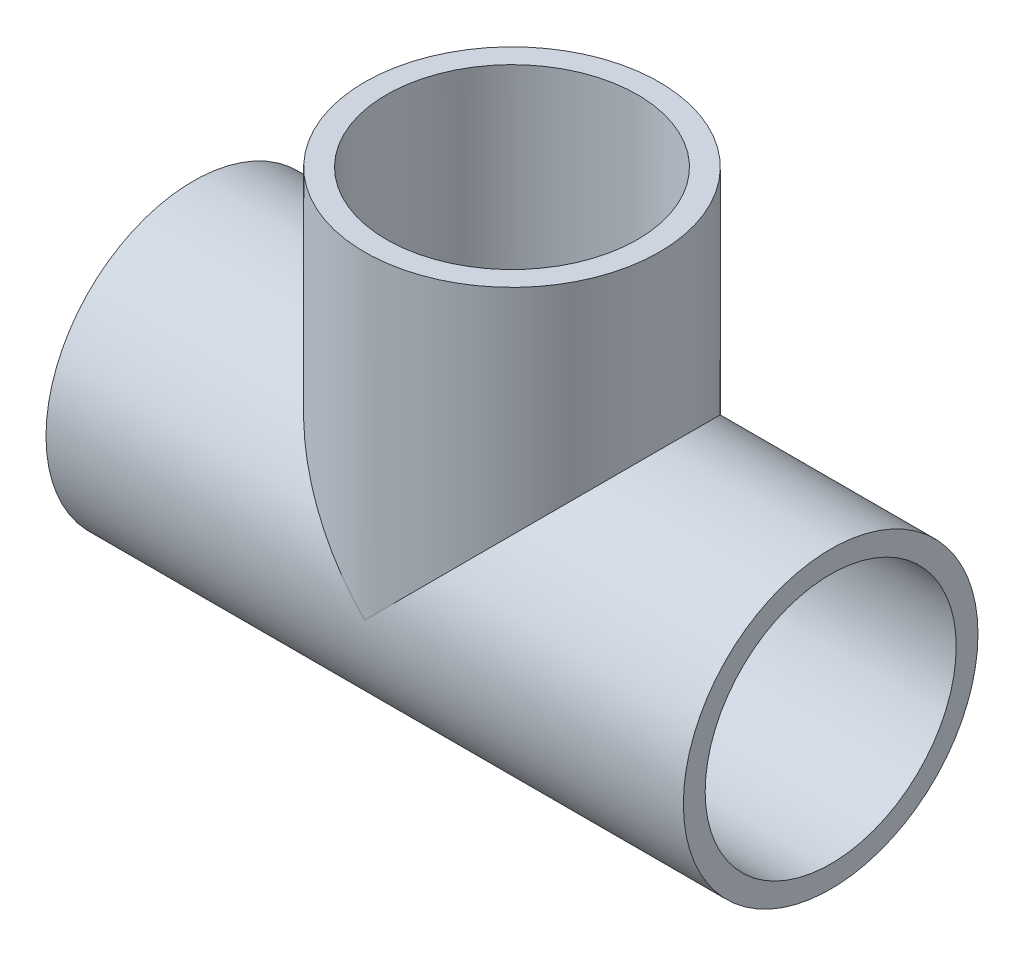
ISO-10303-21;
HEADER;
FILE_DESCRIPTION(('STEP AP214'),'2;1');
FILE_NAME('part.step','',(''),(''),'','','');
FILE_SCHEMA(('AUTOMOTIVE_DESIGN { 1 0 10303 214 1 1 1 1 }'));
ENDSEC;
DATA;
#1=APPLICATION_CONTEXT('core data for automotive mechanical design processes');
#2=APPLICATION_PROTOCOL_DEFINITION('international standard','automotive_design',2000,#1);
#3=PRODUCT_CONTEXT('',#1,'mechanical');
#4=PRODUCT('Part','Part','',(#3));
#5=PRODUCT_RELATED_PRODUCT_CATEGORY('part','',(#4));
#6=PRODUCT_DEFINITION_FORMATION('','',#4);
#7=PRODUCT_DEFINITION_CONTEXT('part definition',#1,'design');
#8=PRODUCT_DEFINITION('design','',#6,#7);
#9=PRODUCT_DEFINITION_SHAPE('','',#8);
#10=(LENGTH_UNIT() NAMED_UNIT(*) SI_UNIT(.MILLI.,.METRE.));
#11=(NAMED_UNIT(*) PLANE_ANGLE_UNIT() SI_UNIT($,.RADIAN.));
#12=(NAMED_UNIT(*) SI_UNIT($,.STERADIAN.) SOLID_ANGLE_UNIT());
#13=UNCERTAINTY_MEASURE_WITH_UNIT(LENGTH_MEASURE(1.E-05),#10,'distance_accuracy_value','');
#14=(GEOMETRIC_REPRESENTATION_CONTEXT(3) GLOBAL_UNCERTAINTY_ASSIGNED_CONTEXT((#13)) GLOBAL_UNIT_ASSIGNED_CONTEXT((#10,
#11,#12)) REPRESENTATION_CONTEXT('',''));
#15=CARTESIAN_POINT('',(0.,0.,0.));
#16=DIRECTION('',(0.,0.,1.));
#17=DIRECTION('',(1.,0.,0.));
#18=AXIS2_PLACEMENT_3D('',#15,#16,#17);
#19=CARTESIAN_POINT('',(-22.225,0.,0.));
#20=DIRECTION('',(1.,0.,0.));
#21=DIRECTION('',(0.,0.,-1.));
#22=AXIS2_PLACEMENT_3D('',#19,#20,#21);
#23=PLANE('',#22);
#24=CARTESIAN_POINT('',(-22.225,0.,0.));
#25=DIRECTION('',(-1.,0.,0.));
#26=DIRECTION('',(0.,0.,1.));
#27=AXIS2_PLACEMENT_3D('',#24,#25,#26);
#28=CIRCLE('',#27,21.0185);
#29=CARTESIAN_POINT('',(-22.225,0.,21.0185));
#30=VERTEX_POINT('',#29);
#31=EDGE_CURVE('E88',#30,#30,#28,.T.);
#32=ORIENTED_EDGE('',*,*,#31,.T.);
#33=EDGE_LOOP('',(#32));
#34=FACE_BOUND('',#33,.T.);
#35=CARTESIAN_POINT('',(-22.225,0.,0.));
#36=DIRECTION('',(1.,0.,0.));
#37=DIRECTION('',(0.,0.,-1.));
#38=AXIS2_PLACEMENT_3D('',#35,#36,#37);
#39=CIRCLE('',#38,17.526);
#40=CARTESIAN_POINT('',(-22.225,0.,-17.526));
#41=VERTEX_POINT('',#40);
#42=EDGE_CURVE('E71',#41,#41,#39,.T.);
#43=ORIENTED_EDGE('',*,*,#42,.T.);
#44=EDGE_LOOP('',(#43));
#45=FACE_BOUND('',#44,.T.);
#46=ADVANCED_FACE('F32',(#34,#45),#23,.F.);
#47=CARTESIAN_POINT('',(22.225,0.,0.));
#48=DIRECTION('',(1.,0.,0.));
#49=DIRECTION('',(0.,0.,-1.));
#50=AXIS2_PLACEMENT_3D('',#47,#48,#49);
#51=PLANE('',#50);
#52=CARTESIAN_POINT('',(22.225,0.,0.));
#53=DIRECTION('',(1.,0.,0.));
#54=DIRECTION('',(0.,0.,-1.));
#55=AXIS2_PLACEMENT_3D('',#52,#53,#54);
#56=CIRCLE('',#55,17.526);
#57=CARTESIAN_POINT('',(22.225,0.,-17.526));
#58=VERTEX_POINT('',#57);
#59=EDGE_CURVE('E68',#58,#58,#56,.T.);
#60=ORIENTED_EDGE('',*,*,#59,.F.);
#61=EDGE_LOOP('',(#60));
#62=FACE_BOUND('',#61,.T.);
#63=CARTESIAN_POINT('',(22.225,0.,0.));
#64=DIRECTION('',(1.,0.,0.));
#65=DIRECTION('',(0.,0.,-1.));
#66=AXIS2_PLACEMENT_3D('',#63,#64,#65);
#67=CIRCLE('',#66,21.0185);
#68=CARTESIAN_POINT('',(22.225,0.,-21.0185));
#69=VERTEX_POINT('',#68);
#70=EDGE_CURVE('E59',#69,#69,#67,.F.);
#71=ORIENTED_EDGE('',*,*,#70,.F.);
#72=EDGE_LOOP('',(#71));
#73=FACE_BOUND('',#72,.T.);
#74=ADVANCED_FACE('F110',(#62,#73),#51,.T.);
#75=CARTESIAN_POINT('',(22.225,0.,0.));
#76=DIRECTION('',(-1.,0.,0.));
#77=DIRECTION('',(0.,0.,1.));
#78=AXIS2_PLACEMENT_3D('',#75,#76,#77);
#79=CYLINDRICAL_SURFACE('',#78,24.892);
#80=CARTESIAN_POINT('',(-53.848,0.,0.));
#81=DIRECTION('',(-1.,0.,0.));
#82=DIRECTION('',(0.,0.,1.));
#83=AXIS2_PLACEMENT_3D('',#80,#81,#82);
#84=CIRCLE('',#83,24.892);
#85=CARTESIAN_POINT('',(-53.848,0.,24.892));
#86=VERTEX_POINT('',#85);
#87=EDGE_CURVE('E85',#86,#86,#84,.T.);
#88=ORIENTED_EDGE('',*,*,#87,.F.);
#89=EDGE_LOOP('',(#88));
#90=FACE_BOUND('',#89,.T.);
#91=CARTESIAN_POINT('',(53.848,0.,0.));
#92=DIRECTION('',(-1.,0.,0.));
#93=DIRECTION('',(0.,0.,1.));
#94=AXIS2_PLACEMENT_3D('',#91,#92,#93);
#95=CIRCLE('',#94,24.892);
#96=CARTESIAN_POINT('',(53.848,0.,24.892));
#97=VERTEX_POINT('',#96);
#98=EDGE_CURVE('E73',#97,#97,#95,.T.);
#99=ORIENTED_EDGE('',*,*,#98,.T.);
#100=EDGE_LOOP('',(#99));
#101=FACE_BOUND('',#100,.T.);
#102=CARTESIAN_POINT('',(0.,0.,0.));
#103=DIRECTION('',(-0.707106781186547,-0.707106781186547,0.));
#104=DIRECTION('',(0.707106781186547,-0.707106781186547,0.));
#105=AXIS2_PLACEMENT_3D('',#102,#103,#104);
#106=ELLIPSE('',#105,35.2026039945911,24.892);
#107=CARTESIAN_POINT('',(0.,0.,24.892));
#108=VERTEX_POINT('',#107);
#109=CARTESIAN_POINT('',(0.,0.,-24.892));
#110=VERTEX_POINT('',#109);
#111=EDGE_CURVE('E94',#108,#110,#106,.T.);
#112=ORIENTED_EDGE('',*,*,#111,.T.);
#113=CARTESIAN_POINT('',(0.,0.,0.));
#114=DIRECTION('',(0.707106781186547,-0.707106781186547,0.));
#115=DIRECTION('',(-0.707106781186547,-0.707106781186547,0.));
#116=AXIS2_PLACEMENT_3D('',#113,#114,#115);
#117=ELLIPSE('',#116,35.2026039945911,24.892);
#118=EDGE_CURVE('E51',#110,#108,#117,.T.);
#119=ORIENTED_EDGE('',*,*,#118,.T.);
#120=EDGE_LOOP('',(#112,#119));
#121=FACE_BOUND('',#120,.T.);
#122=ADVANCED_FACE('F112',(#90,#101,#121),#79,.T.);
#123=CARTESIAN_POINT('',(-22.225,0.,0.));
#124=DIRECTION('',(-1.,0.,0.));
#125=DIRECTION('',(0.,0.,1.));
#126=AXIS2_PLACEMENT_3D('',#123,#124,#125);
#127=CONICAL_SURFACE('',#126,21.0185,0.00602402351617044);
#128=CARTESIAN_POINT('',(-53.848,0.,0.));
#129=DIRECTION('',(-1.,0.,0.));
#130=DIRECTION('',(0.,0.,1.));
#131=AXIS2_PLACEMENT_3D('',#128,#129,#130);
#132=CIRCLE('',#131,21.209);
#133=CARTESIAN_POINT('',(-53.848,0.,21.209));
#134=VERTEX_POINT('',#133);
#135=EDGE_CURVE('E91',#134,#134,#132,.T.);
#136=ORIENTED_EDGE('',*,*,#135,.T.);
#137=EDGE_LOOP('',(#136));
#138=FACE_BOUND('',#137,.T.);
#139=ORIENTED_EDGE('',*,*,#31,.F.);
#140=EDGE_LOOP('',(#139));
#141=FACE_BOUND('',#140,.T.);
#142=ADVANCED_FACE('F119',(#138,#141),#127,.F.);
#143=CARTESIAN_POINT('',(53.848,0.,0.));
#144=DIRECTION('',(1.,0.,0.));
#145=DIRECTION('',(0.,0.,-1.));
#146=AXIS2_PLACEMENT_3D('',#143,#144,#145);
#147=CONICAL_SURFACE('',#146,21.209,0.00602402351617022);
#148=CARTESIAN_POINT('',(53.848,0.,0.));
#149=DIRECTION('',(-1.,0.,0.));
#150=DIRECTION('',(0.,0.,1.));
#151=AXIS2_PLACEMENT_3D('',#148,#149,#150);
#152=CIRCLE('',#151,21.209);
#153=CARTESIAN_POINT('',(53.848,0.,21.209));
#154=VERTEX_POINT('',#153);
#155=EDGE_CURVE('E76',#154,#154,#152,.T.);
#156=ORIENTED_EDGE('',*,*,#155,.F.);
#157=EDGE_LOOP('',(#156));
#158=FACE_BOUND('',#157,.T.);
#159=ORIENTED_EDGE('',*,*,#70,.T.);
#160=EDGE_LOOP('',(#159));
#161=FACE_BOUND('',#160,.T.);
#162=ADVANCED_FACE('F108',(#158,#161),#147,.F.);
#163=CARTESIAN_POINT('',(0.,53.848,0.));
#164=DIRECTION('',(0.,1.,0.));
#165=DIRECTION('',(-1.,0.,0.));
#166=AXIS2_PLACEMENT_3D('',#163,#164,#165);
#167=CONICAL_SURFACE('',#166,21.209,0.00602402351617044);
#168=CARTESIAN_POINT('',(0.,53.848,0.));
#169=DIRECTION('',(0.,-1.,0.));
#170=DIRECTION('',(1.,0.,0.));
#171=AXIS2_PLACEMENT_3D('',#168,#169,#170);
#172=CIRCLE('',#171,21.209);
#173=CARTESIAN_POINT('',(21.209,53.848,0.));
#174=VERTEX_POINT('',#173);
#175=EDGE_CURVE('E96',#174,#174,#172,.T.);
#176=ORIENTED_EDGE('',*,*,#175,.F.);
#177=EDGE_LOOP('',(#176));
#178=FACE_BOUND('',#177,.T.);
#179=CARTESIAN_POINT('',(0.,22.225,0.));
#180=DIRECTION('',(0.,-1.,0.));
#181=DIRECTION('',(1.,0.,0.));
#182=AXIS2_PLACEMENT_3D('',#179,#180,#181);
#183=CIRCLE('',#182,21.0185);
#184=CARTESIAN_POINT('',(21.0185,22.225,0.));
#185=VERTEX_POINT('',#184);
#186=EDGE_CURVE('E99',#185,#185,#183,.T.);
#187=ORIENTED_EDGE('',*,*,#186,.T.);
#188=EDGE_LOOP('',(#187));
#189=FACE_BOUND('',#188,.T.);
#190=ADVANCED_FACE('F128',(#178,#189),#167,.F.);
#191=CARTESIAN_POINT('',(24.892,53.848,0.));
#192=DIRECTION('',(0.,1.,0.));
#193=DIRECTION('',(-1.,0.,0.));
#194=AXIS2_PLACEMENT_3D('',#191,#192,#193);
#195=PLANE('',#194);
#196=ORIENTED_EDGE('',*,*,#175,.T.);
#197=EDGE_LOOP('',(#196));
#198=FACE_BOUND('',#197,.T.);
#199=CARTESIAN_POINT('',(0.,53.848,0.));
#200=DIRECTION('',(0.,-1.,0.));
#201=DIRECTION('',(1.,0.,0.));
#202=AXIS2_PLACEMENT_3D('',#199,#200,#201);
#203=CIRCLE('',#202,24.892);
#204=CARTESIAN_POINT('',(24.892,53.848,0.));
#205=VERTEX_POINT('',#204);
#206=EDGE_CURVE('E102',#205,#205,#203,.T.);
#207=ORIENTED_EDGE('',*,*,#206,.F.);
#208=EDGE_LOOP('',(#207));
#209=FACE_BOUND('',#208,.T.);
#210=ADVANCED_FACE('F34',(#198,#209),#195,.T.);
#211=CARTESIAN_POINT('',(0.,0.,0.));
#212=DIRECTION('',(0.,-1.,0.));
#213=DIRECTION('',(1.,0.,0.));
#214=AXIS2_PLACEMENT_3D('',#211,#212,#213);
#215=CYLINDRICAL_SURFACE('',#214,24.892);
#216=ORIENTED_EDGE('',*,*,#118,.F.);
#217=ORIENTED_EDGE('',*,*,#111,.F.);
#218=EDGE_LOOP('',(#216,#217));
#219=FACE_BOUND('',#218,.T.);
#220=ORIENTED_EDGE('',*,*,#206,.T.);
#221=EDGE_LOOP('',(#220));
#222=FACE_BOUND('',#221,.T.);
#223=ADVANCED_FACE('F131',(#219,#222),#215,.T.);
#224=CARTESIAN_POINT('',(-53.848,-24.892,0.));
#225=DIRECTION('',(-1.,0.,0.));
#226=DIRECTION('',(0.,0.,1.));
#227=AXIS2_PLACEMENT_3D('',#224,#225,#226);
#228=PLANE('',#227);
#229=ORIENTED_EDGE('',*,*,#87,.T.);
#230=EDGE_LOOP('',(#229));
#231=FACE_BOUND('',#230,.T.);
#232=ORIENTED_EDGE('',*,*,#135,.F.);
#233=EDGE_LOOP('',(#232));
#234=FACE_BOUND('',#233,.T.);
#235=ADVANCED_FACE('F125',(#231,#234),#228,.T.);
#236=CARTESIAN_POINT('',(53.848,-24.892,0.));
#237=DIRECTION('',(1.,0.,0.));
#238=DIRECTION('',(0.,0.,-1.));
#239=AXIS2_PLACEMENT_3D('',#236,#237,#238);
#240=PLANE('',#239);
#241=ORIENTED_EDGE('',*,*,#155,.T.);
#242=EDGE_LOOP('',(#241));
#243=FACE_BOUND('',#242,.T.);
#244=ORIENTED_EDGE('',*,*,#98,.F.);
#245=EDGE_LOOP('',(#244));
#246=FACE_BOUND('',#245,.T.);
#247=ADVANCED_FACE('F137',(#243,#246),#240,.T.);
#248=CARTESIAN_POINT('',(0.,22.225,0.));
#249=DIRECTION('',(0.,-1.,0.));
#250=DIRECTION('',(1.,0.,0.));
#251=AXIS2_PLACEMENT_3D('',#248,#249,#250);
#252=PLANE('',#251);
#253=CARTESIAN_POINT('',(0.,22.225,0.));
#254=DIRECTION('',(0.,-1.,0.));
#255=DIRECTION('',(0.,0.,-1.));
#256=AXIS2_PLACEMENT_3D('',#253,#254,#255);
#257=CIRCLE('',#256,17.526);
#258=CARTESIAN_POINT('',(0.,22.225,-17.526));
#259=VERTEX_POINT('',#258);
#260=EDGE_CURVE('E78',#259,#259,#257,.T.);
#261=ORIENTED_EDGE('',*,*,#260,.T.);
#262=EDGE_LOOP('',(#261));
#263=FACE_BOUND('',#262,.T.);
#264=ORIENTED_EDGE('',*,*,#186,.F.);
#265=EDGE_LOOP('',(#264));
#266=FACE_BOUND('',#265,.T.);
#267=ADVANCED_FACE('F63',(#263,#266),#252,.F.);
#268=CARTESIAN_POINT('',(53.848,0.,0.));
#269=DIRECTION('',(1.,0.,0.));
#270=DIRECTION('',(0.,0.,-1.));
#271=AXIS2_PLACEMENT_3D('',#268,#269,#270);
#272=CYLINDRICAL_SURFACE('',#271,17.526);
#273=CARTESIAN_POINT('',(0.,0.,0.));
#274=DIRECTION('',(0.707106781186547,-0.707106781186547,0.));
#275=DIRECTION('',(0.707106781186547,0.707106781186547,0.));
#276=AXIS2_PLACEMENT_3D('',#273,#274,#275);
#277=ELLIPSE('',#276,24.7855068941509,17.526);
#278=CARTESIAN_POINT('',(0.,0.,-17.526));
#279=VERTEX_POINT('',#278);
#280=CARTESIAN_POINT('',(0.,0.,17.526));
#281=VERTEX_POINT('',#280);
#282=EDGE_CURVE('E11',#279,#281,#277,.T.);
#283=ORIENTED_EDGE('',*,*,#282,.F.);
#284=CARTESIAN_POINT('',(0.,0.,0.));
#285=DIRECTION('',(0.707106781186547,0.707106781186547,0.));
#286=DIRECTION('',(0.707106781186547,-0.707106781186547,0.));
#287=AXIS2_PLACEMENT_3D('',#284,#285,#286);
#288=ELLIPSE('',#287,24.7855068941509,17.526);
#289=EDGE_CURVE('E40',#281,#279,#288,.F.);
#290=ORIENTED_EDGE('',*,*,#289,.F.);
#291=EDGE_LOOP('',(#283,#290));
#292=FACE_BOUND('',#291,.T.);
#293=ORIENTED_EDGE('',*,*,#59,.T.);
#294=EDGE_LOOP('',(#293));
#295=FACE_BOUND('',#294,.T.);
#296=ORIENTED_EDGE('',*,*,#42,.F.);
#297=EDGE_LOOP('',(#296));
#298=FACE_BOUND('',#297,.T.);
#299=ADVANCED_FACE('F60',(#292,#295,#298),#272,.F.);
#300=CARTESIAN_POINT('',(0.,0.,0.));
#301=DIRECTION('',(0.,-1.,0.));
#302=DIRECTION('',(0.,0.,-1.));
#303=AXIS2_PLACEMENT_3D('',#300,#301,#302);
#304=CYLINDRICAL_SURFACE('',#303,17.526);
#305=ORIENTED_EDGE('',*,*,#282,.T.);
#306=ORIENTED_EDGE('',*,*,#289,.T.);
#307=EDGE_LOOP('',(#305,#306));
#308=FACE_BOUND('',#307,.T.);
#309=ORIENTED_EDGE('',*,*,#260,.F.);
#310=EDGE_LOOP('',(#309));
#311=FACE_BOUND('',#310,.T.);
#312=ADVANCED_FACE('F56',(#308,#311),#304,.F.);
#313=CLOSED_SHELL('',(#46,#74,#122,#142,#162,#190,#210,#223,#235,#247,#267,#299,#312));
#314=MANIFOLD_SOLID_BREP('B2',#313);
#315=ADVANCED_BREP_SHAPE_REPRESENTATION('',(#18,#314),#14);
#316=SHAPE_DEFINITION_REPRESENTATION(#9,#315);
ENDSEC;
END-ISO-10303-21;
